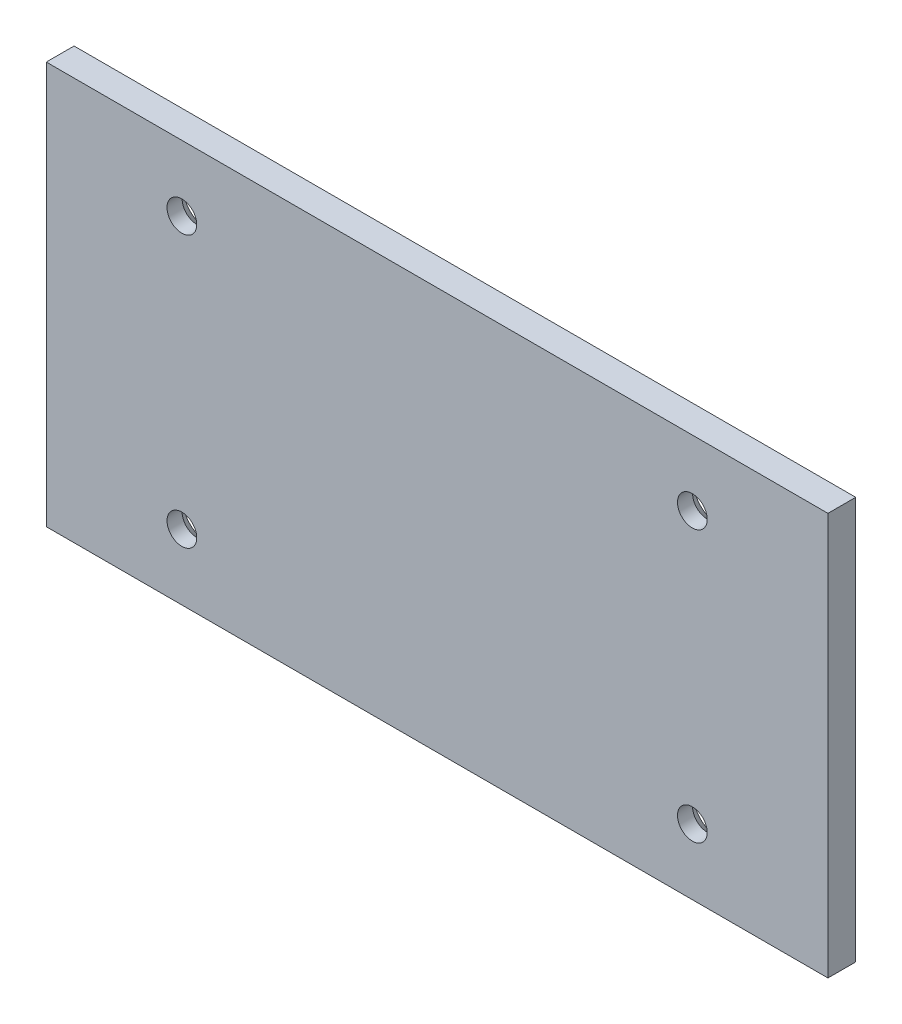
ISO-10303-21;
HEADER;
FILE_DESCRIPTION(('STEP AP214'),'2;1');
FILE_NAME('part.step','',(''),(''),'','','');
FILE_SCHEMA(('AUTOMOTIVE_DESIGN { 1 0 10303 214 1 1 1 1 }'));
ENDSEC;
DATA;
#1=APPLICATION_CONTEXT('core data for automotive mechanical design processes');
#2=APPLICATION_PROTOCOL_DEFINITION('international standard','automotive_design',2000,#1);
#3=PRODUCT_CONTEXT('',#1,'mechanical');
#4=PRODUCT('Part','Part','',(#3));
#5=PRODUCT_RELATED_PRODUCT_CATEGORY('part','',(#4));
#6=PRODUCT_DEFINITION_FORMATION('','',#4);
#7=PRODUCT_DEFINITION_CONTEXT('part definition',#1,'design');
#8=PRODUCT_DEFINITION('design','',#6,#7);
#9=PRODUCT_DEFINITION_SHAPE('','',#8);
#10=(LENGTH_UNIT() NAMED_UNIT(*) SI_UNIT(.MILLI.,.METRE.));
#11=(NAMED_UNIT(*) PLANE_ANGLE_UNIT() SI_UNIT($,.RADIAN.));
#12=(NAMED_UNIT(*) SI_UNIT($,.STERADIAN.) SOLID_ANGLE_UNIT());
#13=UNCERTAINTY_MEASURE_WITH_UNIT(LENGTH_MEASURE(1.E-05),#10,'distance_accuracy_value','');
#14=(GEOMETRIC_REPRESENTATION_CONTEXT(3) GLOBAL_UNCERTAINTY_ASSIGNED_CONTEXT((#13)) GLOBAL_UNIT_ASSIGNED_CONTEXT((#10,
#11,#12)) REPRESENTATION_CONTEXT('',''));
#15=CARTESIAN_POINT('',(0.,0.,0.));
#16=DIRECTION('',(0.,0.,1.));
#17=DIRECTION('',(1.,0.,0.));
#18=AXIS2_PLACEMENT_3D('',#15,#16,#17);
#19=CARTESIAN_POINT('',(-44.674536,23.,3.175));
#20=DIRECTION('',(0.,-1.,0.));
#21=DIRECTION('',(0.,0.,-1.));
#22=AXIS2_PLACEMENT_3D('',#19,#20,#21);
#23=PLANE('',#22);
#24=DIRECTION('',(-1.,0.,0.));
#25=VECTOR('',#24,1.);
#26=CARTESIAN_POINT('',(-44.674536,23.,0.));
#27=LINE('',#26,#25);
#28=CARTESIAN_POINT('',(44.674536,23.,0.));
#29=VERTEX_POINT('',#28);
#30=CARTESIAN_POINT('',(-44.674536,23.,0.));
#31=VERTEX_POINT('',#30);
#32=EDGE_CURVE('E96',#29,#31,#27,.T.);
#33=ORIENTED_EDGE('',*,*,#32,.T.);
#34=DIRECTION('',(0.,0.,-1.));
#35=VECTOR('',#34,1.);
#36=CARTESIAN_POINT('',(-44.674536,23.,3.175));
#37=LINE('',#36,#35);
#38=CARTESIAN_POINT('',(-44.674536,23.,3.175));
#39=VERTEX_POINT('',#38);
#40=EDGE_CURVE('E11',#39,#31,#37,.T.);
#41=ORIENTED_EDGE('',*,*,#40,.F.);
#42=DIRECTION('',(-1.,0.,0.));
#43=VECTOR('',#42,1.);
#44=CARTESIAN_POINT('',(-44.674536,23.,3.175));
#45=LINE('',#44,#43);
#46=CARTESIAN_POINT('',(44.674536,23.,3.175));
#47=VERTEX_POINT('',#46);
#48=EDGE_CURVE('E84',#47,#39,#45,.T.);
#49=ORIENTED_EDGE('',*,*,#48,.F.);
#50=DIRECTION('',(0.,0.,-1.));
#51=VECTOR('',#50,1.);
#52=CARTESIAN_POINT('',(44.674536,23.,3.175));
#53=LINE('',#52,#51);
#54=EDGE_CURVE('E92',#47,#29,#53,.T.);
#55=ORIENTED_EDGE('',*,*,#54,.T.);
#56=EDGE_LOOP('',(#33,#41,#49,#55));
#57=FACE_BOUND('',#56,.T.);
#58=ADVANCED_FACE('F33',(#57),#23,.F.);
#59=CARTESIAN_POINT('',(-44.674536,-23.,3.175));
#60=DIRECTION('',(1.,0.,0.));
#61=DIRECTION('',(0.,0.,-1.));
#62=AXIS2_PLACEMENT_3D('',#59,#60,#61);
#63=PLANE('',#62);
#64=DIRECTION('',(0.,-1.,0.));
#65=VECTOR('',#64,1.);
#66=CARTESIAN_POINT('',(-44.674536,-23.,0.));
#67=LINE('',#66,#65);
#68=CARTESIAN_POINT('',(-44.674536,-23.,0.));
#69=VERTEX_POINT('',#68);
#70=EDGE_CURVE('E88',#31,#69,#67,.T.);
#71=ORIENTED_EDGE('',*,*,#70,.T.);
#72=DIRECTION('',(0.,0.,-1.));
#73=VECTOR('',#72,1.);
#74=CARTESIAN_POINT('',(-44.674536,-23.,3.175));
#75=LINE('',#74,#73);
#76=CARTESIAN_POINT('',(-44.674536,-23.,3.175));
#77=VERTEX_POINT('',#76);
#78=EDGE_CURVE('E41',#77,#69,#75,.T.);
#79=ORIENTED_EDGE('',*,*,#78,.F.);
#80=DIRECTION('',(0.,-1.,0.));
#81=VECTOR('',#80,1.);
#82=CARTESIAN_POINT('',(-44.674536,-23.,3.175));
#83=LINE('',#82,#81);
#84=EDGE_CURVE('E79',#39,#77,#83,.T.);
#85=ORIENTED_EDGE('',*,*,#84,.F.);
#86=ORIENTED_EDGE('',*,*,#40,.T.);
#87=EDGE_LOOP('',(#71,#79,#85,#86));
#88=FACE_BOUND('',#87,.T.);
#89=ADVANCED_FACE('F87',(#88),#63,.F.);
#90=CARTESIAN_POINT('',(-44.674536,-23.,3.175));
#91=DIRECTION('',(0.,1.,0.));
#92=DIRECTION('',(0.,0.,1.));
#93=AXIS2_PLACEMENT_3D('',#90,#91,#92);
#94=PLANE('',#93);
#95=DIRECTION('',(1.,0.,0.));
#96=VECTOR('',#95,1.);
#97=CARTESIAN_POINT('',(-44.674536,-23.,0.));
#98=LINE('',#97,#96);
#99=CARTESIAN_POINT('',(44.674536,-23.,0.));
#100=VERTEX_POINT('',#99);
#101=EDGE_CURVE('E66',#69,#100,#98,.T.);
#102=ORIENTED_EDGE('',*,*,#101,.T.);
#103=DIRECTION('',(0.,0.,-1.));
#104=VECTOR('',#103,1.);
#105=CARTESIAN_POINT('',(44.674536,-23.,3.175));
#106=LINE('',#105,#104);
#107=CARTESIAN_POINT('',(44.674536,-23.,3.175));
#108=VERTEX_POINT('',#107);
#109=EDGE_CURVE('E89',#108,#100,#106,.T.);
#110=ORIENTED_EDGE('',*,*,#109,.F.);
#111=DIRECTION('',(1.,0.,0.));
#112=VECTOR('',#111,1.);
#113=CARTESIAN_POINT('',(-44.674536,-23.,3.175));
#114=LINE('',#113,#112);
#115=EDGE_CURVE('E82',#77,#108,#114,.T.);
#116=ORIENTED_EDGE('',*,*,#115,.F.);
#117=ORIENTED_EDGE('',*,*,#78,.T.);
#118=EDGE_LOOP('',(#102,#110,#116,#117));
#119=FACE_BOUND('',#118,.T.);
#120=ADVANCED_FACE('F90',(#119),#94,.F.);
#121=CARTESIAN_POINT('',(44.674536,23.,3.175));
#122=DIRECTION('',(-1.,0.,0.));
#123=DIRECTION('',(0.,-1.,0.));
#124=AXIS2_PLACEMENT_3D('',#121,#122,#123);
#125=PLANE('',#124);
#126=DIRECTION('',(0.,1.,0.));
#127=VECTOR('',#126,1.);
#128=CARTESIAN_POINT('',(44.674536,23.,0.));
#129=LINE('',#128,#127);
#130=EDGE_CURVE('E72',#100,#29,#129,.T.);
#131=ORIENTED_EDGE('',*,*,#130,.T.);
#132=ORIENTED_EDGE('',*,*,#54,.F.);
#133=DIRECTION('',(0.,1.,0.));
#134=VECTOR('',#133,1.);
#135=CARTESIAN_POINT('',(44.674536,23.,3.175));
#136=LINE('',#135,#134);
#137=EDGE_CURVE('E49',#108,#47,#136,.T.);
#138=ORIENTED_EDGE('',*,*,#137,.F.);
#139=ORIENTED_EDGE('',*,*,#109,.T.);
#140=EDGE_LOOP('',(#131,#132,#138,#139));
#141=FACE_BOUND('',#140,.T.);
#142=ADVANCED_FACE('F104',(#141),#125,.F.);
#143=CARTESIAN_POINT('',(0.,0.,3.175));
#144=DIRECTION('',(0.,0.,-1.));
#145=DIRECTION('',(-1.,0.,0.));
#146=AXIS2_PLACEMENT_3D('',#143,#144,#145);
#147=PLANE('',#146);
#148=CARTESIAN_POINT('',(-29.175456,15.500000014,3.175));
#149=DIRECTION('',(0.,0.,-1.));
#150=DIRECTION('',(-1.,0.,0.));
#151=AXIS2_PLACEMENT_3D('',#148,#149,#150);
#152=CIRCLE('',#151,1.7);
#153=CARTESIAN_POINT('',(-30.875456,15.500000014,3.175));
#154=VERTEX_POINT('',#153);
#155=EDGE_CURVE('E136',#154,#154,#152,.T.);
#156=ORIENTED_EDGE('',*,*,#155,.T.);
#157=EDGE_LOOP('',(#156));
#158=FACE_BOUND('',#157,.T.);
#159=CARTESIAN_POINT('',(-29.175456,-15.500000014,3.175));
#160=DIRECTION('',(0.,0.,-1.));
#161=DIRECTION('',(-1.,0.,0.));
#162=AXIS2_PLACEMENT_3D('',#159,#160,#161);
#163=CIRCLE('',#162,1.7);
#164=CARTESIAN_POINT('',(-30.875456,-15.500000014,3.175));
#165=VERTEX_POINT('',#164);
#166=EDGE_CURVE('E127',#165,#165,#163,.T.);
#167=ORIENTED_EDGE('',*,*,#166,.T.);
#168=EDGE_LOOP('',(#167));
#169=FACE_BOUND('',#168,.T.);
#170=CARTESIAN_POINT('',(29.175456,-15.500000014,3.175));
#171=DIRECTION('',(0.,0.,-1.));
#172=DIRECTION('',(-1.,0.,0.));
#173=AXIS2_PLACEMENT_3D('',#170,#171,#172);
#174=CIRCLE('',#173,1.7);
#175=CARTESIAN_POINT('',(27.475456,-15.500000014,3.175));
#176=VERTEX_POINT('',#175);
#177=EDGE_CURVE('E118',#176,#176,#174,.T.);
#178=ORIENTED_EDGE('',*,*,#177,.T.);
#179=EDGE_LOOP('',(#178));
#180=FACE_BOUND('',#179,.T.);
#181=CARTESIAN_POINT('',(29.175456,15.500000014,3.175));
#182=DIRECTION('',(0.,0.,-1.));
#183=DIRECTION('',(-1.,0.,0.));
#184=AXIS2_PLACEMENT_3D('',#181,#182,#183);
#185=CIRCLE('',#184,1.7);
#186=CARTESIAN_POINT('',(27.475456,15.500000014,3.175));
#187=VERTEX_POINT('',#186);
#188=EDGE_CURVE('E99',#187,#187,#185,.T.);
#189=ORIENTED_EDGE('',*,*,#188,.T.);
#190=EDGE_LOOP('',(#189));
#191=FACE_BOUND('',#190,.T.);
#192=ORIENTED_EDGE('',*,*,#48,.T.);
#193=ORIENTED_EDGE('',*,*,#84,.T.);
#194=ORIENTED_EDGE('',*,*,#115,.T.);
#195=ORIENTED_EDGE('',*,*,#137,.T.);
#196=EDGE_LOOP('',(#192,#193,#194,#195));
#197=FACE_BOUND('',#196,.T.);
#198=ADVANCED_FACE('F80',(#158,#169,#180,#191,#197),#147,.F.);
#199=CARTESIAN_POINT('',(0.,0.,0.));
#200=DIRECTION('',(0.,0.,-1.));
#201=DIRECTION('',(-1.,0.,0.));
#202=AXIS2_PLACEMENT_3D('',#199,#200,#201);
#203=PLANE('',#202);
#204=CARTESIAN_POINT('',(-29.175456,15.500000014,0.));
#205=DIRECTION('',(0.,0.,-1.));
#206=DIRECTION('',(-1.,0.,0.));
#207=AXIS2_PLACEMENT_3D('',#204,#205,#206);
#208=CIRCLE('',#207,3.15);
#209=CARTESIAN_POINT('',(-32.325456,15.500000014,0.));
#210=VERTEX_POINT('',#209);
#211=EDGE_CURVE('E142',#210,#210,#208,.T.);
#212=ORIENTED_EDGE('',*,*,#211,.F.);
#213=EDGE_LOOP('',(#212));
#214=FACE_BOUND('',#213,.T.);
#215=CARTESIAN_POINT('',(-29.175456,-15.500000014,0.));
#216=DIRECTION('',(0.,0.,-1.));
#217=DIRECTION('',(-1.,0.,0.));
#218=AXIS2_PLACEMENT_3D('',#215,#216,#217);
#219=CIRCLE('',#218,3.15);
#220=CARTESIAN_POINT('',(-32.325456,-15.500000014,0.));
#221=VERTEX_POINT('',#220);
#222=EDGE_CURVE('E133',#221,#221,#219,.T.);
#223=ORIENTED_EDGE('',*,*,#222,.F.);
#224=EDGE_LOOP('',(#223));
#225=FACE_BOUND('',#224,.T.);
#226=CARTESIAN_POINT('',(29.175456,-15.500000014,0.));
#227=DIRECTION('',(0.,0.,-1.));
#228=DIRECTION('',(-1.,0.,0.));
#229=AXIS2_PLACEMENT_3D('',#226,#227,#228);
#230=CIRCLE('',#229,3.15);
#231=CARTESIAN_POINT('',(26.025456,-15.500000014,0.));
#232=VERTEX_POINT('',#231);
#233=EDGE_CURVE('E124',#232,#232,#230,.T.);
#234=ORIENTED_EDGE('',*,*,#233,.F.);
#235=EDGE_LOOP('',(#234));
#236=FACE_BOUND('',#235,.T.);
#237=CARTESIAN_POINT('',(29.175456,15.500000014,0.));
#238=DIRECTION('',(0.,0.,-1.));
#239=DIRECTION('',(-1.,0.,0.));
#240=AXIS2_PLACEMENT_3D('',#237,#238,#239);
#241=CIRCLE('',#240,3.15);
#242=CARTESIAN_POINT('',(26.025456,15.500000014,0.));
#243=VERTEX_POINT('',#242);
#244=EDGE_CURVE('E115',#243,#243,#241,.T.);
#245=ORIENTED_EDGE('',*,*,#244,.F.);
#246=EDGE_LOOP('',(#245));
#247=FACE_BOUND('',#246,.T.);
#248=ORIENTED_EDGE('',*,*,#32,.F.);
#249=ORIENTED_EDGE('',*,*,#130,.F.);
#250=ORIENTED_EDGE('',*,*,#101,.F.);
#251=ORIENTED_EDGE('',*,*,#70,.F.);
#252=EDGE_LOOP('',(#248,#249,#250,#251));
#253=FACE_BOUND('',#252,.T.);
#254=ADVANCED_FACE('F107',(#214,#225,#236,#247,#253),#203,.T.);
#255=CARTESIAN_POINT('',(29.175456,15.500000014,0.));
#256=DIRECTION('',(0.,0.,-1.));
#257=DIRECTION('',(-1.,0.,0.));
#258=AXIS2_PLACEMENT_3D('',#255,#256,#257);
#259=CYLINDRICAL_SURFACE('',#258,1.69999999999999);
#260=ORIENTED_EDGE('',*,*,#188,.F.);
#261=EDGE_LOOP('',(#260));
#262=FACE_BOUND('',#261,.T.);
#263=CARTESIAN_POINT('',(29.175456,15.500000014,1.45000000000001));
#264=DIRECTION('',(0.,0.,-1.));
#265=DIRECTION('',(-1.,0.,0.));
#266=AXIS2_PLACEMENT_3D('',#263,#264,#265);
#267=CIRCLE('',#266,1.69999999999999);
#268=CARTESIAN_POINT('',(27.475456,15.500000014,1.45000000000001));
#269=VERTEX_POINT('',#268);
#270=EDGE_CURVE('E112',#269,#269,#267,.T.);
#271=ORIENTED_EDGE('',*,*,#270,.T.);
#272=EDGE_LOOP('',(#271));
#273=FACE_BOUND('',#272,.T.);
#274=ADVANCED_FACE('F150',(#262,#273),#259,.F.);
#275=CARTESIAN_POINT('',(29.175456,15.500000014,0.));
#276=DIRECTION('',(0.,0.,-1.));
#277=DIRECTION('',(-1.,0.,0.));
#278=AXIS2_PLACEMENT_3D('',#275,#276,#277);
#279=CONICAL_SURFACE('',#278,3.15,0.78539816339745);
#280=ORIENTED_EDGE('',*,*,#270,.F.);
#281=EDGE_LOOP('',(#280));
#282=FACE_BOUND('',#281,.T.);
#283=ORIENTED_EDGE('',*,*,#244,.T.);
#284=EDGE_LOOP('',(#283));
#285=FACE_BOUND('',#284,.T.);
#286=ADVANCED_FACE('F158',(#282,#285),#279,.F.);
#287=CARTESIAN_POINT('',(29.175456,-15.500000014,0.));
#288=DIRECTION('',(0.,0.,-1.));
#289=DIRECTION('',(-1.,0.,0.));
#290=AXIS2_PLACEMENT_3D('',#287,#288,#289);
#291=CYLINDRICAL_SURFACE('',#290,1.69999999999999);
#292=ORIENTED_EDGE('',*,*,#177,.F.);
#293=EDGE_LOOP('',(#292));
#294=FACE_BOUND('',#293,.T.);
#295=CARTESIAN_POINT('',(29.175456,-15.500000014,1.45000000000001));
#296=DIRECTION('',(0.,0.,-1.));
#297=DIRECTION('',(-1.,0.,0.));
#298=AXIS2_PLACEMENT_3D('',#295,#296,#297);
#299=CIRCLE('',#298,1.69999999999999);
#300=CARTESIAN_POINT('',(27.475456,-15.500000014,1.45000000000001));
#301=VERTEX_POINT('',#300);
#302=EDGE_CURVE('E121',#301,#301,#299,.T.);
#303=ORIENTED_EDGE('',*,*,#302,.T.);
#304=EDGE_LOOP('',(#303));
#305=FACE_BOUND('',#304,.T.);
#306=ADVANCED_FACE('F160',(#294,#305),#291,.F.);
#307=CARTESIAN_POINT('',(29.175456,-15.500000014,0.));
#308=DIRECTION('',(0.,0.,-1.));
#309=DIRECTION('',(-1.,0.,0.));
#310=AXIS2_PLACEMENT_3D('',#307,#308,#309);
#311=CONICAL_SURFACE('',#310,3.15,0.78539816339745);
#312=ORIENTED_EDGE('',*,*,#302,.F.);
#313=EDGE_LOOP('',(#312));
#314=FACE_BOUND('',#313,.T.);
#315=ORIENTED_EDGE('',*,*,#233,.T.);
#316=EDGE_LOOP('',(#315));
#317=FACE_BOUND('',#316,.T.);
#318=ADVANCED_FACE('F167',(#314,#317),#311,.F.);
#319=CARTESIAN_POINT('',(-29.175456,-15.500000014,0.));
#320=DIRECTION('',(0.,0.,-1.));
#321=DIRECTION('',(-1.,0.,0.));
#322=AXIS2_PLACEMENT_3D('',#319,#320,#321);
#323=CYLINDRICAL_SURFACE('',#322,1.69999999999999);
#324=ORIENTED_EDGE('',*,*,#166,.F.);
#325=EDGE_LOOP('',(#324));
#326=FACE_BOUND('',#325,.T.);
#327=CARTESIAN_POINT('',(-29.175456,-15.500000014,1.45000000000001));
#328=DIRECTION('',(0.,0.,-1.));
#329=DIRECTION('',(-1.,0.,0.));
#330=AXIS2_PLACEMENT_3D('',#327,#328,#329);
#331=CIRCLE('',#330,1.69999999999999);
#332=CARTESIAN_POINT('',(-30.875456,-15.500000014,1.45000000000001));
#333=VERTEX_POINT('',#332);
#334=EDGE_CURVE('E130',#333,#333,#331,.T.);
#335=ORIENTED_EDGE('',*,*,#334,.T.);
#336=EDGE_LOOP('',(#335));
#337=FACE_BOUND('',#336,.T.);
#338=ADVANCED_FACE('F201',(#326,#337),#323,.F.);
#339=CARTESIAN_POINT('',(-29.175456,-15.500000014,0.));
#340=DIRECTION('',(0.,0.,-1.));
#341=DIRECTION('',(-1.,0.,0.));
#342=AXIS2_PLACEMENT_3D('',#339,#340,#341);
#343=CONICAL_SURFACE('',#342,3.15,0.78539816339745);
#344=ORIENTED_EDGE('',*,*,#334,.F.);
#345=EDGE_LOOP('',(#344));
#346=FACE_BOUND('',#345,.T.);
#347=ORIENTED_EDGE('',*,*,#222,.T.);
#348=EDGE_LOOP('',(#347));
#349=FACE_BOUND('',#348,.T.);
#350=ADVANCED_FACE('F206',(#346,#349),#343,.F.);
#351=CARTESIAN_POINT('',(-29.175456,15.500000014,0.));
#352=DIRECTION('',(0.,0.,-1.));
#353=DIRECTION('',(-1.,0.,0.));
#354=AXIS2_PLACEMENT_3D('',#351,#352,#353);
#355=CYLINDRICAL_SURFACE('',#354,1.69999999999999);
#356=ORIENTED_EDGE('',*,*,#155,.F.);
#357=EDGE_LOOP('',(#356));
#358=FACE_BOUND('',#357,.T.);
#359=CARTESIAN_POINT('',(-29.175456,15.500000014,1.45000000000001));
#360=DIRECTION('',(0.,0.,-1.));
#361=DIRECTION('',(-1.,0.,0.));
#362=AXIS2_PLACEMENT_3D('',#359,#360,#361);
#363=CIRCLE('',#362,1.69999999999999);
#364=CARTESIAN_POINT('',(-30.875456,15.500000014,1.45000000000001));
#365=VERTEX_POINT('',#364);
#366=EDGE_CURVE('E139',#365,#365,#363,.T.);
#367=ORIENTED_EDGE('',*,*,#366,.T.);
#368=EDGE_LOOP('',(#367));
#369=FACE_BOUND('',#368,.T.);
#370=ADVANCED_FACE('F212',(#358,#369),#355,.F.);
#371=CARTESIAN_POINT('',(-29.175456,15.500000014,0.));
#372=DIRECTION('',(0.,0.,-1.));
#373=DIRECTION('',(-1.,0.,0.));
#374=AXIS2_PLACEMENT_3D('',#371,#372,#373);
#375=CONICAL_SURFACE('',#374,3.15,0.78539816339745);
#376=ORIENTED_EDGE('',*,*,#366,.F.);
#377=EDGE_LOOP('',(#376));
#378=FACE_BOUND('',#377,.T.);
#379=ORIENTED_EDGE('',*,*,#211,.T.);
#380=EDGE_LOOP('',(#379));
#381=FACE_BOUND('',#380,.T.);
#382=ADVANCED_FACE('F146',(#378,#381),#375,.F.);
#383=CLOSED_SHELL('',(#58,#89,#120,#142,#198,#254,#274,#286,#306,#318,#338,#350,#370,#382));
#384=MANIFOLD_SOLID_BREP('B2',#383);
#385=ADVANCED_BREP_SHAPE_REPRESENTATION('',(#18,#384),#14);
#386=SHAPE_DEFINITION_REPRESENTATION(#9,#385);
ENDSEC;
END-ISO-10303-21;
